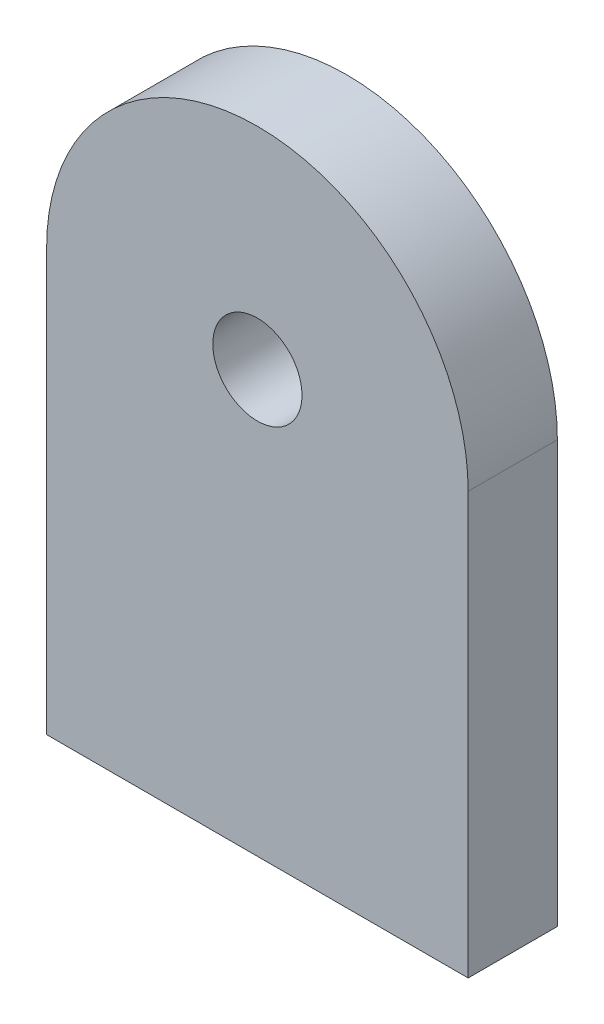
ISO-10303-21;
HEADER;
FILE_DESCRIPTION(('STEP AP214'),'2;1');
FILE_NAME('part.step','',(''),(''),'','','');
FILE_SCHEMA(('AUTOMOTIVE_DESIGN { 1 0 10303 214 1 1 1 1 }'));
ENDSEC;
DATA;
#1=APPLICATION_CONTEXT('core data for automotive mechanical design processes');
#2=APPLICATION_PROTOCOL_DEFINITION('international standard','automotive_design',2000,#1);
#3=PRODUCT_CONTEXT('',#1,'mechanical');
#4=PRODUCT('Part','Part','',(#3));
#5=PRODUCT_RELATED_PRODUCT_CATEGORY('part','',(#4));
#6=PRODUCT_DEFINITION_FORMATION('','',#4);
#7=PRODUCT_DEFINITION_CONTEXT('part definition',#1,'design');
#8=PRODUCT_DEFINITION('design','',#6,#7);
#9=PRODUCT_DEFINITION_SHAPE('','',#8);
#10=(LENGTH_UNIT() NAMED_UNIT(*) SI_UNIT(.MILLI.,.METRE.));
#11=(NAMED_UNIT(*) PLANE_ANGLE_UNIT() SI_UNIT($,.RADIAN.));
#12=(NAMED_UNIT(*) SI_UNIT($,.STERADIAN.) SOLID_ANGLE_UNIT());
#13=UNCERTAINTY_MEASURE_WITH_UNIT(LENGTH_MEASURE(1.E-05),#10,'distance_accuracy_value','');
#14=(GEOMETRIC_REPRESENTATION_CONTEXT(3) GLOBAL_UNCERTAINTY_ASSIGNED_CONTEXT((#13)) GLOBAL_UNIT_ASSIGNED_CONTEXT((#10,
#11,#12)) REPRESENTATION_CONTEXT('',''));
#15=CARTESIAN_POINT('',(0.,0.,0.));
#16=DIRECTION('',(0.,0.,1.));
#17=DIRECTION('',(1.,0.,0.));
#18=AXIS2_PLACEMENT_3D('',#15,#16,#17);
#19=CARTESIAN_POINT('',(0.,0.,6.35));
#20=DIRECTION('',(1.,0.,0.));
#21=DIRECTION('',(0.,0.,-1.));
#22=AXIS2_PLACEMENT_3D('',#19,#20,#21);
#23=PLANE('',#22);
#24=DIRECTION('',(0.,-1.,0.));
#25=VECTOR('',#24,1.);
#26=CARTESIAN_POINT('',(0.,0.,0.));
#27=LINE('',#26,#25);
#28=CARTESIAN_POINT('',(0.,30.,0.));
#29=VERTEX_POINT('',#28);
#30=CARTESIAN_POINT('',(0.,0.,0.));
#31=VERTEX_POINT('',#30);
#32=EDGE_CURVE('E96',#29,#31,#27,.T.);
#33=ORIENTED_EDGE('',*,*,#32,.T.);
#34=DIRECTION('',(0.,0.,-1.));
#35=VECTOR('',#34,1.);
#36=CARTESIAN_POINT('',(0.,0.,6.35));
#37=LINE('',#36,#35);
#38=CARTESIAN_POINT('',(0.,0.,6.35));
#39=VERTEX_POINT('',#38);
#40=EDGE_CURVE('E11',#39,#31,#37,.T.);
#41=ORIENTED_EDGE('',*,*,#40,.F.);
#42=DIRECTION('',(0.,-1.,0.));
#43=VECTOR('',#42,1.);
#44=CARTESIAN_POINT('',(0.,0.,6.35));
#45=LINE('',#44,#43);
#46=CARTESIAN_POINT('',(0.,30.,6.35));
#47=VERTEX_POINT('',#46);
#48=EDGE_CURVE('E84',#47,#39,#45,.T.);
#49=ORIENTED_EDGE('',*,*,#48,.F.);
#50=DIRECTION('',(0.,0.,-1.));
#51=VECTOR('',#50,1.);
#52=CARTESIAN_POINT('',(0.,30.,6.35));
#53=LINE('',#52,#51);
#54=EDGE_CURVE('E92',#47,#29,#53,.T.);
#55=ORIENTED_EDGE('',*,*,#54,.T.);
#56=EDGE_LOOP('',(#33,#41,#49,#55));
#57=FACE_BOUND('',#56,.T.);
#58=ADVANCED_FACE('F33',(#57),#23,.F.);
#59=CARTESIAN_POINT('',(0.,0.,6.35));
#60=DIRECTION('',(0.,1.,0.));
#61=DIRECTION('',(0.,0.,1.));
#62=AXIS2_PLACEMENT_3D('',#59,#60,#61);
#63=PLANE('',#62);
#64=DIRECTION('',(1.,0.,0.));
#65=VECTOR('',#64,1.);
#66=CARTESIAN_POINT('',(0.,0.,0.));
#67=LINE('',#66,#65);
#68=CARTESIAN_POINT('',(30.,0.,0.));
#69=VERTEX_POINT('',#68);
#70=EDGE_CURVE('E88',#31,#69,#67,.T.);
#71=ORIENTED_EDGE('',*,*,#70,.T.);
#72=DIRECTION('',(0.,0.,-1.));
#73=VECTOR('',#72,1.);
#74=CARTESIAN_POINT('',(30.,0.,6.35));
#75=LINE('',#74,#73);
#76=CARTESIAN_POINT('',(30.,0.,6.35));
#77=VERTEX_POINT('',#76);
#78=EDGE_CURVE('E41',#77,#69,#75,.T.);
#79=ORIENTED_EDGE('',*,*,#78,.F.);
#80=DIRECTION('',(1.,0.,0.));
#81=VECTOR('',#80,1.);
#82=CARTESIAN_POINT('',(0.,0.,6.35));
#83=LINE('',#82,#81);
#84=EDGE_CURVE('E79',#39,#77,#83,.T.);
#85=ORIENTED_EDGE('',*,*,#84,.F.);
#86=ORIENTED_EDGE('',*,*,#40,.T.);
#87=EDGE_LOOP('',(#71,#79,#85,#86));
#88=FACE_BOUND('',#87,.T.);
#89=ADVANCED_FACE('F87',(#88),#63,.F.);
#90=CARTESIAN_POINT('',(30.,0.,6.35));
#91=DIRECTION('',(-1.,0.,0.));
#92=DIRECTION('',(0.,-1.,0.));
#93=AXIS2_PLACEMENT_3D('',#90,#91,#92);
#94=PLANE('',#93);
#95=DIRECTION('',(0.,1.,0.));
#96=VECTOR('',#95,1.);
#97=CARTESIAN_POINT('',(30.,0.,0.));
#98=LINE('',#97,#96);
#99=CARTESIAN_POINT('',(30.,30.,0.));
#100=VERTEX_POINT('',#99);
#101=EDGE_CURVE('E66',#69,#100,#98,.T.);
#102=ORIENTED_EDGE('',*,*,#101,.T.);
#103=DIRECTION('',(0.,0.,-1.));
#104=VECTOR('',#103,1.);
#105=CARTESIAN_POINT('',(30.,30.,6.35));
#106=LINE('',#105,#104);
#107=CARTESIAN_POINT('',(30.,30.,6.35));
#108=VERTEX_POINT('',#107);
#109=EDGE_CURVE('E89',#108,#100,#106,.T.);
#110=ORIENTED_EDGE('',*,*,#109,.F.);
#111=DIRECTION('',(0.,1.,0.));
#112=VECTOR('',#111,1.);
#113=CARTESIAN_POINT('',(30.,0.,6.35));
#114=LINE('',#113,#112);
#115=EDGE_CURVE('E82',#77,#108,#114,.T.);
#116=ORIENTED_EDGE('',*,*,#115,.F.);
#117=ORIENTED_EDGE('',*,*,#78,.T.);
#118=EDGE_LOOP('',(#102,#110,#116,#117));
#119=FACE_BOUND('',#118,.T.);
#120=ADVANCED_FACE('F90',(#119),#94,.F.);
#121=CARTESIAN_POINT('',(15.,30.,6.35));
#122=DIRECTION('',(0.,0.,-1.));
#123=DIRECTION('',(-1.,0.,0.));
#124=AXIS2_PLACEMENT_3D('',#121,#122,#123);
#125=CYLINDRICAL_SURFACE('',#124,15.);
#126=CARTESIAN_POINT('',(15.,30.,0.));
#127=DIRECTION('',(0.,0.,1.));
#128=DIRECTION('',(-1.,0.,0.));
#129=AXIS2_PLACEMENT_3D('',#126,#127,#128);
#130=CIRCLE('',#129,15.);
#131=EDGE_CURVE('E72',#100,#29,#130,.T.);
#132=ORIENTED_EDGE('',*,*,#131,.T.);
#133=ORIENTED_EDGE('',*,*,#54,.F.);
#134=CARTESIAN_POINT('',(15.,30.,6.35));
#135=DIRECTION('',(0.,0.,1.));
#136=DIRECTION('',(-1.,0.,0.));
#137=AXIS2_PLACEMENT_3D('',#134,#135,#136);
#138=CIRCLE('',#137,15.);
#139=EDGE_CURVE('E49',#108,#47,#138,.T.);
#140=ORIENTED_EDGE('',*,*,#139,.F.);
#141=ORIENTED_EDGE('',*,*,#109,.T.);
#142=EDGE_LOOP('',(#132,#133,#140,#141));
#143=FACE_BOUND('',#142,.T.);
#144=ADVANCED_FACE('F104',(#143),#125,.T.);
#145=CARTESIAN_POINT('',(15.,30.,6.35));
#146=DIRECTION('',(0.,0.,-1.));
#147=DIRECTION('',(-1.,0.,0.));
#148=AXIS2_PLACEMENT_3D('',#145,#146,#147);
#149=PLANE('',#148);
#150=CARTESIAN_POINT('',(15.,30.,6.35));
#151=DIRECTION('',(0.,0.,1.));
#152=DIRECTION('',(1.,0.,0.));
#153=AXIS2_PLACEMENT_3D('',#150,#151,#152);
#154=CIRCLE('',#153,3.17499999999999);
#155=CARTESIAN_POINT('',(18.175,30.,6.35));
#156=VERTEX_POINT('',#155);
#157=EDGE_CURVE('E112',#156,#156,#154,.T.);
#158=ORIENTED_EDGE('',*,*,#157,.F.);
#159=EDGE_LOOP('',(#158));
#160=FACE_BOUND('',#159,.T.);
#161=ORIENTED_EDGE('',*,*,#48,.T.);
#162=ORIENTED_EDGE('',*,*,#84,.T.);
#163=ORIENTED_EDGE('',*,*,#115,.T.);
#164=ORIENTED_EDGE('',*,*,#139,.T.);
#165=EDGE_LOOP('',(#161,#162,#163,#164));
#166=FACE_BOUND('',#165,.T.);
#167=ADVANCED_FACE('F80',(#160,#166),#149,.F.);
#168=CARTESIAN_POINT('',(15.,30.,0.));
#169=DIRECTION('',(0.,0.,-1.));
#170=DIRECTION('',(-1.,0.,0.));
#171=AXIS2_PLACEMENT_3D('',#168,#169,#170);
#172=PLANE('',#171);
#173=CARTESIAN_POINT('',(15.,30.,0.));
#174=DIRECTION('',(0.,0.,-1.));
#175=DIRECTION('',(-1.,0.,0.));
#176=AXIS2_PLACEMENT_3D('',#173,#174,#175);
#177=CIRCLE('',#176,3.17499999999999);
#178=CARTESIAN_POINT('',(11.825,30.,0.));
#179=VERTEX_POINT('',#178);
#180=EDGE_CURVE('E99',#179,#179,#177,.T.);
#181=ORIENTED_EDGE('',*,*,#180,.F.);
#182=EDGE_LOOP('',(#181));
#183=FACE_BOUND('',#182,.T.);
#184=ORIENTED_EDGE('',*,*,#32,.F.);
#185=ORIENTED_EDGE('',*,*,#131,.F.);
#186=ORIENTED_EDGE('',*,*,#101,.F.);
#187=ORIENTED_EDGE('',*,*,#70,.F.);
#188=EDGE_LOOP('',(#184,#185,#186,#187));
#189=FACE_BOUND('',#188,.T.);
#190=ADVANCED_FACE('F107',(#183,#189),#172,.T.);
#191=CARTESIAN_POINT('',(15.,30.,6.35));
#192=DIRECTION('',(0.,0.,1.));
#193=DIRECTION('',(1.,0.,0.));
#194=AXIS2_PLACEMENT_3D('',#191,#192,#193);
#195=CYLINDRICAL_SURFACE('',#194,3.17499999999999);
#196=ORIENTED_EDGE('',*,*,#180,.T.);
#197=EDGE_LOOP('',(#196));
#198=FACE_BOUND('',#197,.T.);
#199=ORIENTED_EDGE('',*,*,#157,.T.);
#200=EDGE_LOOP('',(#199));
#201=FACE_BOUND('',#200,.T.);
#202=ADVANCED_FACE('F116',(#198,#201),#195,.F.);
#203=CLOSED_SHELL('',(#58,#89,#120,#144,#167,#190,#202));
#204=MANIFOLD_SOLID_BREP('B2',#203);
#205=ADVANCED_BREP_SHAPE_REPRESENTATION('',(#18,#204),#14);
#206=SHAPE_DEFINITION_REPRESENTATION(#9,#205);
ENDSEC;
END-ISO-10303-21;
